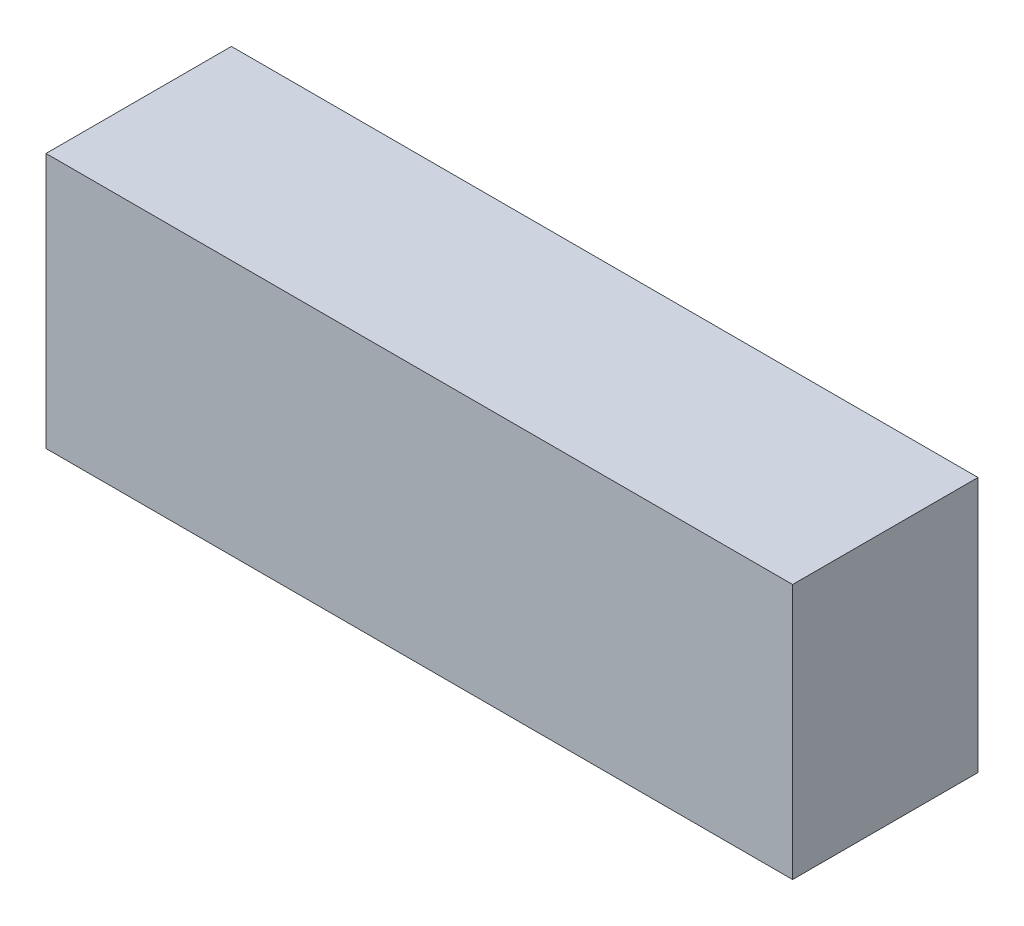
ISO-10303-21;
HEADER;
FILE_DESCRIPTION(('STEP AP214'),'2;1');
FILE_NAME('part.step','',(''),(''),'','','');
FILE_SCHEMA(('AUTOMOTIVE_DESIGN { 1 0 10303 214 1 1 1 1 }'));
ENDSEC;
DATA;
#1=APPLICATION_CONTEXT('core data for automotive mechanical design processes');
#2=APPLICATION_PROTOCOL_DEFINITION('international standard','automotive_design',2000,#1);
#3=PRODUCT_CONTEXT('',#1,'mechanical');
#4=PRODUCT('Part','Part','',(#3));
#5=PRODUCT_RELATED_PRODUCT_CATEGORY('part','',(#4));
#6=PRODUCT_DEFINITION_FORMATION('','',#4);
#7=PRODUCT_DEFINITION_CONTEXT('part definition',#1,'design');
#8=PRODUCT_DEFINITION('design','',#6,#7);
#9=PRODUCT_DEFINITION_SHAPE('','',#8);
#10=(LENGTH_UNIT() NAMED_UNIT(*) SI_UNIT(.MILLI.,.METRE.));
#11=(NAMED_UNIT(*) PLANE_ANGLE_UNIT() SI_UNIT($,.RADIAN.));
#12=(NAMED_UNIT(*) SI_UNIT($,.STERADIAN.) SOLID_ANGLE_UNIT());
#13=UNCERTAINTY_MEASURE_WITH_UNIT(LENGTH_MEASURE(1.E-05),#10,'distance_accuracy_value','');
#14=(GEOMETRIC_REPRESENTATION_CONTEXT(3) GLOBAL_UNCERTAINTY_ASSIGNED_CONTEXT((#13)) GLOBAL_UNIT_ASSIGNED_CONTEXT((#10,
#11,#12)) REPRESENTATION_CONTEXT('',''));
#15=CARTESIAN_POINT('',(0.,0.,0.));
#16=DIRECTION('',(0.,0.,1.));
#17=DIRECTION('',(1.,0.,0.));
#18=AXIS2_PLACEMENT_3D('',#15,#16,#17);
#19=CARTESIAN_POINT('',(0.,51.,0.));
#20=DIRECTION('',(1.,0.,0.));
#21=DIRECTION('',(0.,0.,-1.));
#22=AXIS2_PLACEMENT_3D('',#19,#20,#21);
#23=PLANE('',#22);
#24=DIRECTION('',(0.,0.,1.));
#25=VECTOR('',#24,1.);
#26=CARTESIAN_POINT('',(0.,0.,0.));
#27=LINE('',#26,#25);
#28=CARTESIAN_POINT('',(0.,0.,-37.));
#29=VERTEX_POINT('',#28);
#30=CARTESIAN_POINT('',(0.,0.,0.));
#31=VERTEX_POINT('',#30);
#32=EDGE_CURVE('E98',#29,#31,#27,.T.);
#33=ORIENTED_EDGE('',*,*,#32,.T.);
#34=DIRECTION('',(0.,-1.,0.));
#35=VECTOR('',#34,1.);
#36=CARTESIAN_POINT('',(0.,51.,0.));
#37=LINE('',#36,#35);
#38=CARTESIAN_POINT('',(0.,51.,0.));
#39=VERTEX_POINT('',#38);
#40=EDGE_CURVE('E11',#39,#31,#37,.T.);
#41=ORIENTED_EDGE('',*,*,#40,.F.);
#42=DIRECTION('',(0.,0.,1.));
#43=VECTOR('',#42,1.);
#44=CARTESIAN_POINT('',(0.,51.,0.));
#45=LINE('',#44,#43);
#46=CARTESIAN_POINT('',(0.,51.,-37.));
#47=VERTEX_POINT('',#46);
#48=EDGE_CURVE('E86',#47,#39,#45,.T.);
#49=ORIENTED_EDGE('',*,*,#48,.F.);
#50=DIRECTION('',(0.,-1.,0.));
#51=VECTOR('',#50,1.);
#52=CARTESIAN_POINT('',(0.,51.,-37.));
#53=LINE('',#52,#51);
#54=EDGE_CURVE('E94',#47,#29,#53,.T.);
#55=ORIENTED_EDGE('',*,*,#54,.T.);
#56=EDGE_LOOP('',(#33,#41,#49,#55));
#57=FACE_BOUND('',#56,.T.);
#58=ADVANCED_FACE('F35',(#57),#23,.F.);
#59=CARTESIAN_POINT('',(0.,51.,0.));
#60=DIRECTION('',(0.,0.,-1.));
#61=DIRECTION('',(-1.,0.,0.));
#62=AXIS2_PLACEMENT_3D('',#59,#60,#61);
#63=PLANE('',#62);
#64=DIRECTION('',(1.,0.,0.));
#65=VECTOR('',#64,1.);
#66=CARTESIAN_POINT('',(0.,0.,0.));
#67=LINE('',#66,#65);
#68=CARTESIAN_POINT('',(149.,0.,0.));
#69=VERTEX_POINT('',#68);
#70=EDGE_CURVE('E90',#31,#69,#67,.T.);
#71=ORIENTED_EDGE('',*,*,#70,.T.);
#72=DIRECTION('',(0.,-1.,0.));
#73=VECTOR('',#72,1.);
#74=CARTESIAN_POINT('',(149.,51.,0.));
#75=LINE('',#74,#73);
#76=CARTESIAN_POINT('',(149.,51.,0.));
#77=VERTEX_POINT('',#76);
#78=EDGE_CURVE('E43',#77,#69,#75,.T.);
#79=ORIENTED_EDGE('',*,*,#78,.F.);
#80=DIRECTION('',(1.,0.,0.));
#81=VECTOR('',#80,1.);
#82=CARTESIAN_POINT('',(0.,51.,0.));
#83=LINE('',#82,#81);
#84=EDGE_CURVE('E81',#39,#77,#83,.T.);
#85=ORIENTED_EDGE('',*,*,#84,.F.);
#86=ORIENTED_EDGE('',*,*,#40,.T.);
#87=EDGE_LOOP('',(#71,#79,#85,#86));
#88=FACE_BOUND('',#87,.T.);
#89=ADVANCED_FACE('F89',(#88),#63,.F.);
#90=CARTESIAN_POINT('',(149.,51.,0.));
#91=DIRECTION('',(-1.,0.,0.));
#92=DIRECTION('',(0.,0.,1.));
#93=AXIS2_PLACEMENT_3D('',#90,#91,#92);
#94=PLANE('',#93);
#95=DIRECTION('',(0.,0.,-1.));
#96=VECTOR('',#95,1.);
#97=CARTESIAN_POINT('',(149.,0.,0.));
#98=LINE('',#97,#96);
#99=CARTESIAN_POINT('',(149.,0.,-37.));
#100=VERTEX_POINT('',#99);
#101=EDGE_CURVE('E68',#69,#100,#98,.T.);
#102=ORIENTED_EDGE('',*,*,#101,.T.);
#103=DIRECTION('',(0.,-1.,0.));
#104=VECTOR('',#103,1.);
#105=CARTESIAN_POINT('',(149.,51.,-37.));
#106=LINE('',#105,#104);
#107=CARTESIAN_POINT('',(149.,51.,-37.));
#108=VERTEX_POINT('',#107);
#109=EDGE_CURVE('E91',#108,#100,#106,.T.);
#110=ORIENTED_EDGE('',*,*,#109,.F.);
#111=DIRECTION('',(0.,0.,-1.));
#112=VECTOR('',#111,1.);
#113=CARTESIAN_POINT('',(149.,51.,0.));
#114=LINE('',#113,#112);
#115=EDGE_CURVE('E84',#77,#108,#114,.T.);
#116=ORIENTED_EDGE('',*,*,#115,.F.);
#117=ORIENTED_EDGE('',*,*,#78,.T.);
#118=EDGE_LOOP('',(#102,#110,#116,#117));
#119=FACE_BOUND('',#118,.T.);
#120=ADVANCED_FACE('F92',(#119),#94,.F.);
#121=CARTESIAN_POINT('',(0.,51.,-37.));
#122=DIRECTION('',(0.,0.,1.));
#123=DIRECTION('',(1.,0.,0.));
#124=AXIS2_PLACEMENT_3D('',#121,#122,#123);
#125=PLANE('',#124);
#126=DIRECTION('',(-1.,0.,0.));
#127=VECTOR('',#126,1.);
#128=CARTESIAN_POINT('',(0.,0.,-37.));
#129=LINE('',#128,#127);
#130=EDGE_CURVE('E74',#100,#29,#129,.T.);
#131=ORIENTED_EDGE('',*,*,#130,.T.);
#132=ORIENTED_EDGE('',*,*,#54,.F.);
#133=DIRECTION('',(-1.,0.,0.));
#134=VECTOR('',#133,1.);
#135=CARTESIAN_POINT('',(0.,51.,-37.));
#136=LINE('',#135,#134);
#137=EDGE_CURVE('E51',#108,#47,#136,.T.);
#138=ORIENTED_EDGE('',*,*,#137,.F.);
#139=ORIENTED_EDGE('',*,*,#109,.T.);
#140=EDGE_LOOP('',(#131,#132,#138,#139));
#141=FACE_BOUND('',#140,.T.);
#142=ADVANCED_FACE('F105',(#141),#125,.F.);
#143=CARTESIAN_POINT('',(0.,51.,-37.));
#144=DIRECTION('',(0.,-1.,0.));
#145=DIRECTION('',(0.,0.,-1.));
#146=AXIS2_PLACEMENT_3D('',#143,#144,#145);
#147=PLANE('',#146);
#148=ORIENTED_EDGE('',*,*,#48,.T.);
#149=ORIENTED_EDGE('',*,*,#84,.T.);
#150=ORIENTED_EDGE('',*,*,#115,.T.);
#151=ORIENTED_EDGE('',*,*,#137,.T.);
#152=EDGE_LOOP('',(#148,#149,#150,#151));
#153=FACE_BOUND('',#152,.T.);
#154=ADVANCED_FACE('F82',(#153),#147,.F.);
#155=CARTESIAN_POINT('',(0.,0.,-37.));
#156=DIRECTION('',(0.,-1.,0.));
#157=DIRECTION('',(0.,0.,-1.));
#158=AXIS2_PLACEMENT_3D('',#155,#156,#157);
#159=PLANE('',#158);
#160=ORIENTED_EDGE('',*,*,#32,.F.);
#161=ORIENTED_EDGE('',*,*,#130,.F.);
#162=ORIENTED_EDGE('',*,*,#101,.F.);
#163=ORIENTED_EDGE('',*,*,#70,.F.);
#164=EDGE_LOOP('',(#160,#161,#162,#163));
#165=FACE_BOUND('',#164,.T.);
#166=ADVANCED_FACE('F108',(#165),#159,.T.);
#167=CLOSED_SHELL('',(#58,#89,#120,#142,#154,#166));
#168=MANIFOLD_SOLID_BREP('B2',#167);
#169=ADVANCED_BREP_SHAPE_REPRESENTATION('',(#18,#168),#14);
#170=SHAPE_DEFINITION_REPRESENTATION(#9,#169);
ENDSEC;
END-ISO-10303-21;
